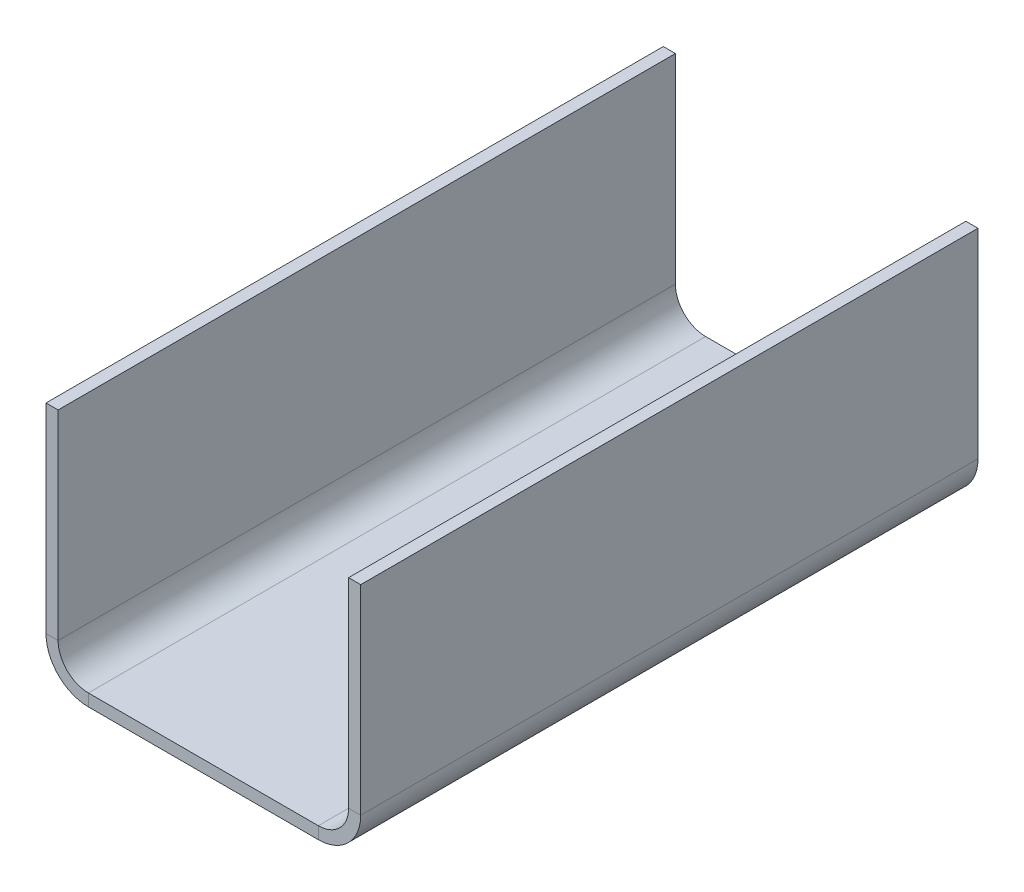
ISO-10303-21;
HEADER;
FILE_DESCRIPTION(('STEP AP214'),'2;1');
FILE_NAME('part.step','',(''),(''),'','','');
FILE_SCHEMA(('AUTOMOTIVE_DESIGN { 1 0 10303 214 1 1 1 1 }'));
ENDSEC;
DATA;
#1=APPLICATION_CONTEXT('core data for automotive mechanical design processes');
#2=APPLICATION_PROTOCOL_DEFINITION('international standard','automotive_design',2000,#1);
#3=PRODUCT_CONTEXT('',#1,'mechanical');
#4=PRODUCT('Part','Part','',(#3));
#5=PRODUCT_RELATED_PRODUCT_CATEGORY('part','',(#4));
#6=PRODUCT_DEFINITION_FORMATION('','',#4);
#7=PRODUCT_DEFINITION_CONTEXT('part definition',#1,'design');
#8=PRODUCT_DEFINITION('design','',#6,#7);
#9=PRODUCT_DEFINITION_SHAPE('','',#8);
#10=(LENGTH_UNIT() NAMED_UNIT(*) SI_UNIT(.MILLI.,.METRE.));
#11=(NAMED_UNIT(*) PLANE_ANGLE_UNIT() SI_UNIT($,.RADIAN.));
#12=(NAMED_UNIT(*) SI_UNIT($,.STERADIAN.) SOLID_ANGLE_UNIT());
#13=UNCERTAINTY_MEASURE_WITH_UNIT(LENGTH_MEASURE(1.E-05),#10,'distance_accuracy_value','');
#14=(GEOMETRIC_REPRESENTATION_CONTEXT(3) GLOBAL_UNCERTAINTY_ASSIGNED_CONTEXT((#13)) GLOBAL_UNIT_ASSIGNED_CONTEXT((#10,
#11,#12)) REPRESENTATION_CONTEXT('',''));
#15=CARTESIAN_POINT('',(0.,0.,0.));
#16=DIRECTION('',(0.,0.,1.));
#17=DIRECTION('',(1.,0.,0.));
#18=AXIS2_PLACEMENT_3D('',#15,#16,#17);
#19=CARTESIAN_POINT('',(25.,-190.,510.));
#20=DIRECTION('',(0.,0.,1.));
#21=DIRECTION('',(1.,0.,0.));
#22=AXIS2_PLACEMENT_3D('',#19,#20,#21);
#23=PLANE('',#22);
#24=DIRECTION('',(0.,-1.,0.));
#25=VECTOR('',#24,1.);
#26=CARTESIAN_POINT('',(25.,-190.,510.));
#27=LINE('',#26,#25);
#28=CARTESIAN_POINT('',(25.,-190.,510.));
#29=VERTEX_POINT('',#28);
#30=CARTESIAN_POINT('',(25.,-200.,510.));
#31=VERTEX_POINT('',#30);
#32=EDGE_CURVE('E11',#29,#31,#27,.T.);
#33=ORIENTED_EDGE('',*,*,#32,.F.);
#34=CARTESIAN_POINT('',(25.,-165.,510.));
#35=DIRECTION('',(0.,0.,-1.));
#36=DIRECTION('',(-1.,0.,0.));
#37=AXIS2_PLACEMENT_3D('',#34,#35,#36);
#38=CIRCLE('',#37,25.);
#39=CARTESIAN_POINT('',(0.,-165.,510.));
#40=VERTEX_POINT('',#39);
#41=EDGE_CURVE('E248',#40,#29,#38,.F.);
#42=ORIENTED_EDGE('',*,*,#41,.F.);
#43=DIRECTION('',(1.,0.,0.));
#44=VECTOR('',#43,1.);
#45=CARTESIAN_POINT('',(-10.,-165.,510.));
#46=LINE('',#45,#44);
#47=CARTESIAN_POINT('',(-10.,-165.,510.));
#48=VERTEX_POINT('',#47);
#49=EDGE_CURVE('E46',#48,#40,#46,.T.);
#50=ORIENTED_EDGE('',*,*,#49,.F.);
#51=CARTESIAN_POINT('',(25.,-165.,510.));
#52=DIRECTION('',(0.,0.,1.));
#53=DIRECTION('',(1.,0.,0.));
#54=AXIS2_PLACEMENT_3D('',#51,#52,#53);
#55=CIRCLE('',#54,35.);
#56=EDGE_CURVE('E147',#48,#31,#55,.T.);
#57=ORIENTED_EDGE('',*,*,#56,.T.);
#58=EDGE_LOOP('',(#33,#42,#50,#57));
#59=FACE_BOUND('',#58,.T.);
#60=ADVANCED_FACE('F38',(#59),#23,.T.);
#61=CARTESIAN_POINT('',(-10.,-165.,510.));
#62=DIRECTION('',(0.,0.,1.));
#63=DIRECTION('',(1.,0.,0.));
#64=AXIS2_PLACEMENT_3D('',#61,#62,#63);
#65=PLANE('',#64);
#66=DIRECTION('',(1.,0.,0.));
#67=VECTOR('',#66,1.);
#68=CARTESIAN_POINT('',(0.,-190.,510.));
#69=LINE('',#68,#67);
#70=CARTESIAN_POINT('',(215.,-190.,510.));
#71=VERTEX_POINT('',#70);
#72=EDGE_CURVE('E141',#29,#71,#69,.T.);
#73=ORIENTED_EDGE('',*,*,#72,.F.);
#74=ORIENTED_EDGE('',*,*,#32,.T.);
#75=DIRECTION('',(1.,0.,0.));
#76=VECTOR('',#75,1.);
#77=CARTESIAN_POINT('',(0.,-200.,510.));
#78=LINE('',#77,#76);
#79=CARTESIAN_POINT('',(215.,-200.,510.));
#80=VERTEX_POINT('',#79);
#81=EDGE_CURVE('E138',#31,#80,#78,.T.);
#82=ORIENTED_EDGE('',*,*,#81,.T.);
#83=DIRECTION('',(0.,1.,0.));
#84=VECTOR('',#83,1.);
#85=CARTESIAN_POINT('',(215.,-200.,510.));
#86=LINE('',#85,#84);
#87=EDGE_CURVE('E229',#80,#71,#86,.T.);
#88=ORIENTED_EDGE('',*,*,#87,.T.);
#89=EDGE_LOOP('',(#73,#74,#82,#88));
#90=FACE_BOUND('',#89,.T.);
#91=ADVANCED_FACE('F136',(#90),#65,.T.);
#92=CARTESIAN_POINT('',(0.,-165.,0.));
#93=DIRECTION('',(0.,0.,-1.));
#94=DIRECTION('',(-1.,0.,0.));
#95=AXIS2_PLACEMENT_3D('',#92,#93,#94);
#96=PLANE('',#95);
#97=DIRECTION('',(-1.,0.,0.));
#98=VECTOR('',#97,1.);
#99=CARTESIAN_POINT('',(0.,-165.,0.));
#100=LINE('',#99,#98);
#101=CARTESIAN_POINT('',(0.,-165.,0.));
#102=VERTEX_POINT('',#101);
#103=CARTESIAN_POINT('',(-10.,-165.,0.));
#104=VERTEX_POINT('',#103);
#105=EDGE_CURVE('E234',#102,#104,#100,.T.);
#106=ORIENTED_EDGE('',*,*,#105,.F.);
#107=CARTESIAN_POINT('',(25.,-165.,0.));
#108=DIRECTION('',(0.,0.,-1.));
#109=DIRECTION('',(-1.,0.,0.));
#110=AXIS2_PLACEMENT_3D('',#107,#108,#109);
#111=CIRCLE('',#110,25.);
#112=CARTESIAN_POINT('',(25.,-190.,0.));
#113=VERTEX_POINT('',#112);
#114=EDGE_CURVE('E186',#102,#113,#111,.F.);
#115=ORIENTED_EDGE('',*,*,#114,.T.);
#116=DIRECTION('',(0.,1.,0.));
#117=VECTOR('',#116,1.);
#118=CARTESIAN_POINT('',(25.,-200.,0.));
#119=LINE('',#118,#117);
#120=CARTESIAN_POINT('',(25.,-200.,0.));
#121=VERTEX_POINT('',#120);
#122=EDGE_CURVE('E232',#121,#113,#119,.T.);
#123=ORIENTED_EDGE('',*,*,#122,.F.);
#124=CARTESIAN_POINT('',(25.,-165.,0.));
#125=DIRECTION('',(0.,0.,1.));
#126=DIRECTION('',(1.,0.,0.));
#127=AXIS2_PLACEMENT_3D('',#124,#125,#126);
#128=CIRCLE('',#127,35.);
#129=EDGE_CURVE('E159',#104,#121,#128,.T.);
#130=ORIENTED_EDGE('',*,*,#129,.F.);
#131=EDGE_LOOP('',(#106,#115,#123,#130));
#132=FACE_BOUND('',#131,.T.);
#133=ADVANCED_FACE('F286',(#132),#96,.T.);
#134=CARTESIAN_POINT('',(25.,-200.,0.));
#135=DIRECTION('',(0.,0.,-1.));
#136=DIRECTION('',(-1.,0.,0.));
#137=AXIS2_PLACEMENT_3D('',#134,#135,#136);
#138=PLANE('',#137);
#139=DIRECTION('',(0.,-1.,0.));
#140=VECTOR('',#139,1.);
#141=CARTESIAN_POINT('',(0.,0.,0.));
#142=LINE('',#141,#140);
#143=CARTESIAN_POINT('',(0.,0.,0.));
#144=VERTEX_POINT('',#143);
#145=EDGE_CURVE('E189',#144,#102,#142,.T.);
#146=ORIENTED_EDGE('',*,*,#145,.T.);
#147=ORIENTED_EDGE('',*,*,#105,.T.);
#148=DIRECTION('',(0.,1.,0.));
#149=VECTOR('',#148,1.);
#150=CARTESIAN_POINT('',(-10.,0.,0.));
#151=LINE('',#150,#149);
#152=CARTESIAN_POINT('',(-10.,0.,0.));
#153=VERTEX_POINT('',#152);
#154=EDGE_CURVE('E195',#153,#104,#151,.F.);
#155=ORIENTED_EDGE('',*,*,#154,.F.);
#156=DIRECTION('',(1.,0.,0.));
#157=VECTOR('',#156,1.);
#158=CARTESIAN_POINT('',(-10.,0.,0.));
#159=LINE('',#158,#157);
#160=EDGE_CURVE('E192',#153,#144,#159,.T.);
#161=ORIENTED_EDGE('',*,*,#160,.T.);
#162=EDGE_LOOP('',(#146,#147,#155,#161));
#163=FACE_BOUND('',#162,.T.);
#164=ADVANCED_FACE('F289',(#163),#138,.T.);
#165=CARTESIAN_POINT('',(240.,-165.,510.));
#166=DIRECTION('',(0.,0.,1.));
#167=DIRECTION('',(1.,0.,0.));
#168=AXIS2_PLACEMENT_3D('',#165,#166,#167);
#169=PLANE('',#168);
#170=DIRECTION('',(1.,0.,0.));
#171=VECTOR('',#170,1.);
#172=CARTESIAN_POINT('',(240.,-165.,510.));
#173=LINE('',#172,#171);
#174=CARTESIAN_POINT('',(240.,-165.,510.));
#175=VERTEX_POINT('',#174);
#176=CARTESIAN_POINT('',(250.,-165.,510.));
#177=VERTEX_POINT('',#176);
#178=EDGE_CURVE('E54',#175,#177,#173,.T.);
#179=ORIENTED_EDGE('',*,*,#178,.F.);
#180=CARTESIAN_POINT('',(215.,-165.,510.));
#181=DIRECTION('',(0.,0.,-1.));
#182=DIRECTION('',(-1.,0.,0.));
#183=AXIS2_PLACEMENT_3D('',#180,#181,#182);
#184=CIRCLE('',#183,25.);
#185=EDGE_CURVE('E258',#71,#175,#184,.F.);
#186=ORIENTED_EDGE('',*,*,#185,.F.);
#187=ORIENTED_EDGE('',*,*,#87,.F.);
#188=CARTESIAN_POINT('',(215.,-165.,510.));
#189=DIRECTION('',(0.,0.,1.));
#190=DIRECTION('',(1.,0.,0.));
#191=AXIS2_PLACEMENT_3D('',#188,#189,#190);
#192=CIRCLE('',#191,35.);
#193=EDGE_CURVE('E167',#80,#177,#192,.T.);
#194=ORIENTED_EDGE('',*,*,#193,.T.);
#195=EDGE_LOOP('',(#179,#186,#187,#194));
#196=FACE_BOUND('',#195,.T.);
#197=ADVANCED_FACE('F281',(#196),#169,.T.);
#198=CARTESIAN_POINT('',(215.,-200.,510.));
#199=DIRECTION('',(0.,0.,1.));
#200=DIRECTION('',(1.,0.,0.));
#201=AXIS2_PLACEMENT_3D('',#198,#199,#200);
#202=PLANE('',#201);
#203=DIRECTION('',(0.,1.,0.));
#204=VECTOR('',#203,1.);
#205=CARTESIAN_POINT('',(240.,-190.,510.));
#206=LINE('',#205,#204);
#207=CARTESIAN_POINT('',(240.,0.,510.));
#208=VERTEX_POINT('',#207);
#209=EDGE_CURVE('E261',#175,#208,#206,.T.);
#210=ORIENTED_EDGE('',*,*,#209,.F.);
#211=ORIENTED_EDGE('',*,*,#178,.T.);
#212=DIRECTION('',(0.,1.,0.));
#213=VECTOR('',#212,1.);
#214=CARTESIAN_POINT('',(250.,-190.,510.));
#215=LINE('',#214,#213);
#216=CARTESIAN_POINT('',(250.,0.,510.));
#217=VERTEX_POINT('',#216);
#218=EDGE_CURVE('E108',#177,#217,#215,.T.);
#219=ORIENTED_EDGE('',*,*,#218,.T.);
#220=DIRECTION('',(1.,0.,0.));
#221=VECTOR('',#220,1.);
#222=CARTESIAN_POINT('',(240.,0.,510.));
#223=LINE('',#222,#221);
#224=EDGE_CURVE('E264',#208,#217,#223,.T.);
#225=ORIENTED_EDGE('',*,*,#224,.F.);
#226=EDGE_LOOP('',(#210,#211,#219,#225));
#227=FACE_BOUND('',#226,.T.);
#228=ADVANCED_FACE('F270',(#227),#202,.T.);
#229=CARTESIAN_POINT('',(215.,-190.,0.));
#230=DIRECTION('',(0.,0.,-1.));
#231=DIRECTION('',(-1.,0.,0.));
#232=AXIS2_PLACEMENT_3D('',#229,#230,#231);
#233=PLANE('',#232);
#234=DIRECTION('',(0.,-1.,0.));
#235=VECTOR('',#234,1.);
#236=CARTESIAN_POINT('',(215.,-190.,0.));
#237=LINE('',#236,#235);
#238=CARTESIAN_POINT('',(215.,-190.,0.));
#239=VERTEX_POINT('',#238);
#240=CARTESIAN_POINT('',(215.,-200.,0.));
#241=VERTEX_POINT('',#240);
#242=EDGE_CURVE('E95',#239,#241,#237,.T.);
#243=ORIENTED_EDGE('',*,*,#242,.F.);
#244=CARTESIAN_POINT('',(215.,-165.,0.));
#245=DIRECTION('',(0.,0.,-1.));
#246=DIRECTION('',(-1.,0.,0.));
#247=AXIS2_PLACEMENT_3D('',#244,#245,#246);
#248=CIRCLE('',#247,25.);
#249=CARTESIAN_POINT('',(240.,-165.,0.));
#250=VERTEX_POINT('',#249);
#251=EDGE_CURVE('E182',#239,#250,#248,.F.);
#252=ORIENTED_EDGE('',*,*,#251,.T.);
#253=DIRECTION('',(-1.,0.,0.));
#254=VECTOR('',#253,1.);
#255=CARTESIAN_POINT('',(250.,-165.,0.));
#256=LINE('',#255,#254);
#257=CARTESIAN_POINT('',(250.,-165.,0.));
#258=VERTEX_POINT('',#257);
#259=EDGE_CURVE('E102',#258,#250,#256,.T.);
#260=ORIENTED_EDGE('',*,*,#259,.F.);
#261=CARTESIAN_POINT('',(215.,-165.,0.));
#262=DIRECTION('',(0.,0.,1.));
#263=DIRECTION('',(1.,0.,0.));
#264=AXIS2_PLACEMENT_3D('',#261,#262,#263);
#265=CIRCLE('',#264,35.);
#266=EDGE_CURVE('E201',#241,#258,#265,.T.);
#267=ORIENTED_EDGE('',*,*,#266,.F.);
#268=EDGE_LOOP('',(#243,#252,#260,#267));
#269=FACE_BOUND('',#268,.T.);
#270=ADVANCED_FACE('F318',(#269),#233,.T.);
#271=CARTESIAN_POINT('',(250.,-165.,0.));
#272=DIRECTION('',(0.,0.,-1.));
#273=DIRECTION('',(-1.,0.,0.));
#274=AXIS2_PLACEMENT_3D('',#271,#272,#273);
#275=PLANE('',#274);
#276=DIRECTION('',(1.,0.,0.));
#277=VECTOR('',#276,1.);
#278=CARTESIAN_POINT('',(0.,-190.,0.));
#279=LINE('',#278,#277);
#280=EDGE_CURVE('E184',#113,#239,#279,.T.);
#281=ORIENTED_EDGE('',*,*,#280,.T.);
#282=ORIENTED_EDGE('',*,*,#242,.T.);
#283=DIRECTION('',(1.,0.,0.));
#284=VECTOR('',#283,1.);
#285=CARTESIAN_POINT('',(0.,-200.,0.));
#286=LINE('',#285,#284);
#287=EDGE_CURVE('E199',#121,#241,#286,.T.);
#288=ORIENTED_EDGE('',*,*,#287,.F.);
#289=ORIENTED_EDGE('',*,*,#122,.T.);
#290=EDGE_LOOP('',(#281,#282,#288,#289));
#291=FACE_BOUND('',#290,.T.);
#292=ADVANCED_FACE('F321',(#291),#275,.T.);
#293=CARTESIAN_POINT('',(250.,-190.,510.));
#294=DIRECTION('',(-1.,0.,0.));
#295=DIRECTION('',(0.,0.,1.));
#296=AXIS2_PLACEMENT_3D('',#293,#294,#295);
#297=PLANE('',#296);
#298=DIRECTION('',(0.,1.,0.));
#299=VECTOR('',#298,1.);
#300=CARTESIAN_POINT('',(250.,-190.,0.));
#301=LINE('',#300,#299);
#302=CARTESIAN_POINT('',(250.,0.,0.));
#303=VERTEX_POINT('',#302);
#304=EDGE_CURVE('E173',#258,#303,#301,.T.);
#305=ORIENTED_EDGE('',*,*,#304,.T.);
#306=DIRECTION('',(0.,0.,-1.));
#307=VECTOR('',#306,1.);
#308=CARTESIAN_POINT('',(250.,0.,510.));
#309=LINE('',#308,#307);
#310=EDGE_CURVE('E225',#217,#303,#309,.T.);
#311=ORIENTED_EDGE('',*,*,#310,.F.);
#312=ORIENTED_EDGE('',*,*,#218,.F.);
#313=DIRECTION('',(0.,0.,-1.));
#314=VECTOR('',#313,1.);
#315=CARTESIAN_POINT('',(250.,-165.,510.));
#316=LINE('',#315,#314);
#317=EDGE_CURVE('E169',#177,#258,#316,.T.);
#318=ORIENTED_EDGE('',*,*,#317,.T.);
#319=EDGE_LOOP('',(#305,#311,#312,#318));
#320=FACE_BOUND('',#319,.T.);
#321=ADVANCED_FACE('F324',(#320),#297,.F.);
#322=CARTESIAN_POINT('',(240.,0.,510.));
#323=DIRECTION('',(0.,1.,0.));
#324=DIRECTION('',(0.,0.,1.));
#325=AXIS2_PLACEMENT_3D('',#322,#323,#324);
#326=PLANE('',#325);
#327=DIRECTION('',(1.,0.,0.));
#328=VECTOR('',#327,1.);
#329=CARTESIAN_POINT('',(240.,0.,0.));
#330=LINE('',#329,#328);
#331=CARTESIAN_POINT('',(240.,0.,0.));
#332=VERTEX_POINT('',#331);
#333=EDGE_CURVE('E176',#332,#303,#330,.T.);
#334=ORIENTED_EDGE('',*,*,#333,.F.);
#335=DIRECTION('',(0.,0.,-1.));
#336=VECTOR('',#335,1.);
#337=CARTESIAN_POINT('',(240.,0.,510.));
#338=LINE('',#337,#336);
#339=EDGE_CURVE('E223',#208,#332,#338,.T.);
#340=ORIENTED_EDGE('',*,*,#339,.F.);
#341=ORIENTED_EDGE('',*,*,#224,.T.);
#342=ORIENTED_EDGE('',*,*,#310,.T.);
#343=EDGE_LOOP('',(#334,#340,#341,#342));
#344=FACE_BOUND('',#343,.T.);
#345=ADVANCED_FACE('F269',(#344),#326,.T.);
#346=CARTESIAN_POINT('',(240.,-190.,510.));
#347=DIRECTION('',(-1.,0.,0.));
#348=DIRECTION('',(0.,0.,1.));
#349=AXIS2_PLACEMENT_3D('',#346,#347,#348);
#350=PLANE('',#349);
#351=DIRECTION('',(0.,1.,0.));
#352=VECTOR('',#351,1.);
#353=CARTESIAN_POINT('',(240.,-190.,0.));
#354=LINE('',#353,#352);
#355=EDGE_CURVE('E179',#250,#332,#354,.T.);
#356=ORIENTED_EDGE('',*,*,#355,.F.);
#357=DIRECTION('',(0.,0.,-1.));
#358=VECTOR('',#357,1.);
#359=CARTESIAN_POINT('',(240.,-165.,510.));
#360=LINE('',#359,#358);
#361=EDGE_CURVE('E220',#175,#250,#360,.T.);
#362=ORIENTED_EDGE('',*,*,#361,.F.);
#363=ORIENTED_EDGE('',*,*,#209,.T.);
#364=ORIENTED_EDGE('',*,*,#339,.T.);
#365=EDGE_LOOP('',(#356,#362,#363,#364));
#366=FACE_BOUND('',#365,.T.);
#367=ADVANCED_FACE('F274',(#366),#350,.T.);
#368=CARTESIAN_POINT('',(215.,-165.,510.));
#369=DIRECTION('',(0.,0.,-1.));
#370=DIRECTION('',(-1.,0.,0.));
#371=AXIS2_PLACEMENT_3D('',#368,#369,#370);
#372=CYLINDRICAL_SURFACE('',#371,25.);
#373=ORIENTED_EDGE('',*,*,#251,.F.);
#374=DIRECTION('',(0.,0.,-1.));
#375=VECTOR('',#374,1.);
#376=CARTESIAN_POINT('',(215.,-190.,510.));
#377=LINE('',#376,#375);
#378=EDGE_CURVE('E217',#71,#239,#377,.T.);
#379=ORIENTED_EDGE('',*,*,#378,.F.);
#380=ORIENTED_EDGE('',*,*,#185,.T.);
#381=ORIENTED_EDGE('',*,*,#361,.T.);
#382=EDGE_LOOP('',(#373,#379,#380,#381));
#383=FACE_BOUND('',#382,.T.);
#384=ADVANCED_FACE('F277',(#383),#372,.F.);
#385=CARTESIAN_POINT('',(0.,-190.,510.));
#386=DIRECTION('',(0.,1.,0.));
#387=DIRECTION('',(0.,0.,1.));
#388=AXIS2_PLACEMENT_3D('',#385,#386,#387);
#389=PLANE('',#388);
#390=ORIENTED_EDGE('',*,*,#280,.F.);
#391=DIRECTION('',(0.,0.,-1.));
#392=VECTOR('',#391,1.);
#393=CARTESIAN_POINT('',(25.,-190.,510.));
#394=LINE('',#393,#392);
#395=EDGE_CURVE('E214',#29,#113,#394,.T.);
#396=ORIENTED_EDGE('',*,*,#395,.F.);
#397=ORIENTED_EDGE('',*,*,#72,.T.);
#398=ORIENTED_EDGE('',*,*,#378,.T.);
#399=EDGE_LOOP('',(#390,#396,#397,#398));
#400=FACE_BOUND('',#399,.T.);
#401=ADVANCED_FACE('F284',(#400),#389,.T.);
#402=CARTESIAN_POINT('',(25.,-165.,510.));
#403=DIRECTION('',(0.,0.,-1.));
#404=DIRECTION('',(-1.,0.,0.));
#405=AXIS2_PLACEMENT_3D('',#402,#403,#404);
#406=CYLINDRICAL_SURFACE('',#405,25.);
#407=ORIENTED_EDGE('',*,*,#114,.F.);
#408=DIRECTION('',(0.,0.,-1.));
#409=VECTOR('',#408,1.);
#410=CARTESIAN_POINT('',(0.,-165.,510.));
#411=LINE('',#410,#409);
#412=EDGE_CURVE('E211',#40,#102,#411,.T.);
#413=ORIENTED_EDGE('',*,*,#412,.F.);
#414=ORIENTED_EDGE('',*,*,#41,.T.);
#415=ORIENTED_EDGE('',*,*,#395,.T.);
#416=EDGE_LOOP('',(#407,#413,#414,#415));
#417=FACE_BOUND('',#416,.T.);
#418=ADVANCED_FACE('F247',(#417),#406,.F.);
#419=CARTESIAN_POINT('',(0.,0.,510.));
#420=DIRECTION('',(1.,0.,0.));
#421=DIRECTION('',(0.,0.,-1.));
#422=AXIS2_PLACEMENT_3D('',#419,#420,#421);
#423=PLANE('',#422);
#424=ORIENTED_EDGE('',*,*,#145,.F.);
#425=DIRECTION('',(0.,0.,-1.));
#426=VECTOR('',#425,1.);
#427=CARTESIAN_POINT('',(0.,0.,510.));
#428=LINE('',#427,#426);
#429=CARTESIAN_POINT('',(0.,0.,510.));
#430=VERTEX_POINT('',#429);
#431=EDGE_CURVE('E209',#430,#144,#428,.T.);
#432=ORIENTED_EDGE('',*,*,#431,.F.);
#433=DIRECTION('',(0.,-1.,0.));
#434=VECTOR('',#433,1.);
#435=CARTESIAN_POINT('',(0.,0.,510.));
#436=LINE('',#435,#434);
#437=EDGE_CURVE('E241',#430,#40,#436,.T.);
#438=ORIENTED_EDGE('',*,*,#437,.T.);
#439=ORIENTED_EDGE('',*,*,#412,.T.);
#440=EDGE_LOOP('',(#424,#432,#438,#439));
#441=FACE_BOUND('',#440,.T.);
#442=ADVANCED_FACE('F252',(#441),#423,.T.);
#443=CARTESIAN_POINT('',(-10.,0.,510.));
#444=DIRECTION('',(0.,1.,0.));
#445=DIRECTION('',(0.,0.,1.));
#446=AXIS2_PLACEMENT_3D('',#443,#444,#445);
#447=PLANE('',#446);
#448=ORIENTED_EDGE('',*,*,#160,.F.);
#449=DIRECTION('',(0.,0.,-1.));
#450=VECTOR('',#449,1.);
#451=CARTESIAN_POINT('',(-10.,0.,510.));
#452=LINE('',#451,#450);
#453=CARTESIAN_POINT('',(-10.,0.,510.));
#454=VERTEX_POINT('',#453);
#455=EDGE_CURVE('E207',#454,#153,#452,.T.);
#456=ORIENTED_EDGE('',*,*,#455,.F.);
#457=DIRECTION('',(1.,0.,0.));
#458=VECTOR('',#457,1.);
#459=CARTESIAN_POINT('',(-10.,0.,510.));
#460=LINE('',#459,#458);
#461=EDGE_CURVE('E253',#454,#430,#460,.T.);
#462=ORIENTED_EDGE('',*,*,#461,.T.);
#463=ORIENTED_EDGE('',*,*,#431,.T.);
#464=EDGE_LOOP('',(#448,#456,#462,#463));
#465=FACE_BOUND('',#464,.T.);
#466=ADVANCED_FACE('F294',(#465),#447,.T.);
#467=CARTESIAN_POINT('',(-10.,0.,510.));
#468=DIRECTION('',(1.,0.,0.));
#469=DIRECTION('',(0.,0.,-1.));
#470=AXIS2_PLACEMENT_3D('',#467,#468,#469);
#471=PLANE('',#470);
#472=ORIENTED_EDGE('',*,*,#154,.T.);
#473=DIRECTION('',(0.,0.,-1.));
#474=VECTOR('',#473,1.);
#475=CARTESIAN_POINT('',(-10.,-165.,510.));
#476=LINE('',#475,#474);
#477=EDGE_CURVE('E161',#48,#104,#476,.T.);
#478=ORIENTED_EDGE('',*,*,#477,.F.);
#479=DIRECTION('',(0.,1.,0.));
#480=VECTOR('',#479,1.);
#481=CARTESIAN_POINT('',(-10.,0.,510.));
#482=LINE('',#481,#480);
#483=EDGE_CURVE('E152',#454,#48,#482,.F.);
#484=ORIENTED_EDGE('',*,*,#483,.F.);
#485=ORIENTED_EDGE('',*,*,#455,.T.);
#486=EDGE_LOOP('',(#472,#478,#484,#485));
#487=FACE_BOUND('',#486,.T.);
#488=ADVANCED_FACE('F292',(#487),#471,.F.);
#489=CARTESIAN_POINT('',(25.,-165.,510.));
#490=DIRECTION('',(0.,0.,-1.));
#491=DIRECTION('',(-1.,0.,0.));
#492=AXIS2_PLACEMENT_3D('',#489,#490,#491);
#493=CYLINDRICAL_SURFACE('',#492,35.);
#494=ORIENTED_EDGE('',*,*,#129,.T.);
#495=DIRECTION('',(0.,0.,-1.));
#496=VECTOR('',#495,1.);
#497=CARTESIAN_POINT('',(25.,-200.,510.));
#498=LINE('',#497,#496);
#499=EDGE_CURVE('E156',#31,#121,#498,.T.);
#500=ORIENTED_EDGE('',*,*,#499,.F.);
#501=ORIENTED_EDGE('',*,*,#56,.F.);
#502=ORIENTED_EDGE('',*,*,#477,.T.);
#503=EDGE_LOOP('',(#494,#500,#501,#502));
#504=FACE_BOUND('',#503,.T.);
#505=ADVANCED_FACE('F157',(#504),#493,.T.);
#506=CARTESIAN_POINT('',(0.,-200.,510.));
#507=DIRECTION('',(0.,1.,0.));
#508=DIRECTION('',(0.,0.,1.));
#509=AXIS2_PLACEMENT_3D('',#506,#507,#508);
#510=PLANE('',#509);
#511=ORIENTED_EDGE('',*,*,#287,.T.);
#512=DIRECTION('',(0.,0.,-1.));
#513=VECTOR('',#512,1.);
#514=CARTESIAN_POINT('',(215.,-200.,510.));
#515=LINE('',#514,#513);
#516=EDGE_CURVE('E162',#80,#241,#515,.T.);
#517=ORIENTED_EDGE('',*,*,#516,.F.);
#518=ORIENTED_EDGE('',*,*,#81,.F.);
#519=ORIENTED_EDGE('',*,*,#499,.T.);
#520=EDGE_LOOP('',(#511,#517,#518,#519));
#521=FACE_BOUND('',#520,.T.);
#522=ADVANCED_FACE('F164',(#521),#510,.F.);
#523=CARTESIAN_POINT('',(215.,-165.,510.));
#524=DIRECTION('',(0.,0.,-1.));
#525=DIRECTION('',(-1.,0.,0.));
#526=AXIS2_PLACEMENT_3D('',#523,#524,#525);
#527=CYLINDRICAL_SURFACE('',#526,35.);
#528=ORIENTED_EDGE('',*,*,#266,.T.);
#529=ORIENTED_EDGE('',*,*,#317,.F.);
#530=ORIENTED_EDGE('',*,*,#193,.F.);
#531=ORIENTED_EDGE('',*,*,#516,.T.);
#532=EDGE_LOOP('',(#528,#529,#530,#531));
#533=FACE_BOUND('',#532,.T.);
#534=ADVANCED_FACE('F376',(#533),#527,.T.);
#535=CARTESIAN_POINT('',(215.,-165.,510.));
#536=DIRECTION('',(0.,0.,-1.));
#537=DIRECTION('',(-1.,0.,0.));
#538=AXIS2_PLACEMENT_3D('',#535,#536,#537);
#539=PLANE('',#538);
#540=ORIENTED_EDGE('',*,*,#483,.T.);
#541=ORIENTED_EDGE('',*,*,#49,.T.);
#542=ORIENTED_EDGE('',*,*,#437,.F.);
#543=ORIENTED_EDGE('',*,*,#461,.F.);
#544=EDGE_LOOP('',(#540,#541,#542,#543));
#545=FACE_BOUND('',#544,.T.);
#546=ADVANCED_FACE('F238',(#545),#539,.F.);
#547=CARTESIAN_POINT('',(215.,-165.,0.));
#548=DIRECTION('',(0.,0.,-1.));
#549=DIRECTION('',(-1.,0.,0.));
#550=AXIS2_PLACEMENT_3D('',#547,#548,#549);
#551=PLANE('',#550);
#552=ORIENTED_EDGE('',*,*,#304,.F.);
#553=ORIENTED_EDGE('',*,*,#259,.T.);
#554=ORIENTED_EDGE('',*,*,#355,.T.);
#555=ORIENTED_EDGE('',*,*,#333,.T.);
#556=EDGE_LOOP('',(#552,#553,#554,#555));
#557=FACE_BOUND('',#556,.T.);
#558=ADVANCED_FACE('F396',(#557),#551,.T.);
#559=CLOSED_SHELL('',(#60,#91,#133,#164,#197,#228,#270,#292,#321,#345,#367,#384,#401,#418,#442,
#466,#488,#505,#522,#534,#546,#558));
#560=MANIFOLD_SOLID_BREP('B2',#559);
#561=ADVANCED_BREP_SHAPE_REPRESENTATION('',(#18,#560),#14);
#562=SHAPE_DEFINITION_REPRESENTATION(#9,#561);
ENDSEC;
END-ISO-10303-21;
